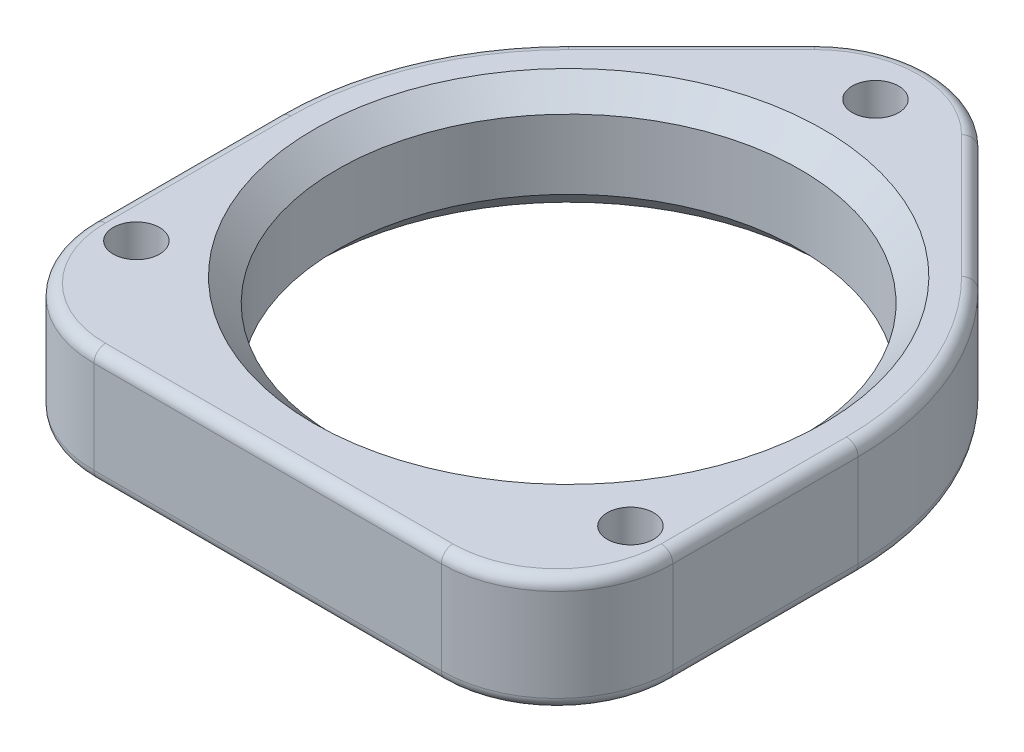
ISO-10303-21;
HEADER;
FILE_DESCRIPTION(('STEP AP214'),'2;1');
FILE_NAME('part.step','',(''),(''),'','','');
FILE_SCHEMA(('AUTOMOTIVE_DESIGN { 1 0 10303 214 1 1 1 1 }'));
ENDSEC;
DATA;
#1=APPLICATION_CONTEXT('core data for automotive mechanical design processes');
#2=APPLICATION_PROTOCOL_DEFINITION('international standard','automotive_design',2000,#1);
#3=PRODUCT_CONTEXT('',#1,'mechanical');
#4=PRODUCT('Part','Part','',(#3));
#5=PRODUCT_RELATED_PRODUCT_CATEGORY('part','',(#4));
#6=PRODUCT_DEFINITION_FORMATION('','',#4);
#7=PRODUCT_DEFINITION_CONTEXT('part definition',#1,'design');
#8=PRODUCT_DEFINITION('design','',#6,#7);
#9=PRODUCT_DEFINITION_SHAPE('','',#8);
#10=(LENGTH_UNIT() NAMED_UNIT(*) SI_UNIT(.MILLI.,.METRE.));
#11=(NAMED_UNIT(*) PLANE_ANGLE_UNIT() SI_UNIT($,.RADIAN.));
#12=(NAMED_UNIT(*) SI_UNIT($,.STERADIAN.) SOLID_ANGLE_UNIT());
#13=UNCERTAINTY_MEASURE_WITH_UNIT(LENGTH_MEASURE(1.E-05),#10,'distance_accuracy_value','');
#14=(GEOMETRIC_REPRESENTATION_CONTEXT(3) GLOBAL_UNCERTAINTY_ASSIGNED_CONTEXT((#13)) GLOBAL_UNIT_ASSIGNED_CONTEXT((#10,
#11,#12)) REPRESENTATION_CONTEXT('',''));
#15=CARTESIAN_POINT('',(0.,0.,0.));
#16=DIRECTION('',(0.,0.,1.));
#17=DIRECTION('',(1.,0.,0.));
#18=AXIS2_PLACEMENT_3D('',#15,#16,#17);
#19=CARTESIAN_POINT('',(0.,10.,0.));
#20=DIRECTION('',(0.,-1.,0.));
#21=DIRECTION('',(0.,0.,-1.));
#22=AXIS2_PLACEMENT_3D('',#19,#20,#21);
#23=CYLINDRICAL_SURFACE('',#22,25.);
#24=DIRECTION('',(0.,1.,0.));
#25=VECTOR('',#24,1.);
#26=CARTESIAN_POINT('',(25.,0.,0.));
#27=LINE('',#26,#25);
#28=CARTESIAN_POINT('',(25.,1.,0.));
#29=VERTEX_POINT('',#28);
#30=CARTESIAN_POINT('',(25.,9.,0.));
#31=VERTEX_POINT('',#30);
#32=EDGE_CURVE('E352',#29,#31,#27,.T.);
#33=ORIENTED_EDGE('',*,*,#32,.F.);
#34=CARTESIAN_POINT('',(0.,0.999999999999999,0.));
#35=DIRECTION('',(0.,1.,0.));
#36=DIRECTION('',(0.,0.,1.));
#37=AXIS2_PLACEMENT_3D('',#34,#35,#36);
#38=CIRCLE('',#37,25.);
#39=CARTESIAN_POINT('',(17.6776695296638,0.999999999999999,-17.6776695296636));
#40=VERTEX_POINT('',#39);
#41=EDGE_CURVE('E257',#29,#40,#38,.T.);
#42=ORIENTED_EDGE('',*,*,#41,.T.);
#43=DIRECTION('',(0.,1.,0.));
#44=VECTOR('',#43,1.);
#45=CARTESIAN_POINT('',(17.6776695296638,0.,-17.6776695296636));
#46=LINE('',#45,#44);
#47=CARTESIAN_POINT('',(17.6776695296638,9.,-17.6776695296636));
#48=VERTEX_POINT('',#47);
#49=EDGE_CURVE('E845',#40,#48,#46,.T.);
#50=ORIENTED_EDGE('',*,*,#49,.T.);
#51=CARTESIAN_POINT('',(0.,9.,0.));
#52=DIRECTION('',(0.,1.,0.));
#53=DIRECTION('',(0.,0.,1.));
#54=AXIS2_PLACEMENT_3D('',#51,#52,#53);
#55=CIRCLE('',#54,25.);
#56=EDGE_CURVE('E255',#48,#31,#55,.F.);
#57=ORIENTED_EDGE('',*,*,#56,.T.);
#58=EDGE_LOOP('',(#33,#42,#50,#57));
#59=FACE_BOUND('',#58,.T.);
#60=ADVANCED_FACE('F41',(#59),#23,.T.);
#61=DIRECTION('',(0.,1.,0.));
#62=VECTOR('',#61,1.);
#63=CARTESIAN_POINT('',(-17.6776695296638,0.,-17.6776695296636));
#64=LINE('',#63,#62);
#65=CARTESIAN_POINT('',(-17.6776695296638,1.,-17.6776695296636));
#66=VERTEX_POINT('',#65);
#67=CARTESIAN_POINT('',(-17.6776695296638,9.,-17.6776695296636));
#68=VERTEX_POINT('',#67);
#69=EDGE_CURVE('E848',#66,#68,#64,.T.);
#70=ORIENTED_EDGE('',*,*,#69,.F.);
#71=CARTESIAN_POINT('',(0.,0.999999999999999,0.));
#72=DIRECTION('',(0.,1.,0.));
#73=DIRECTION('',(0.,0.,1.));
#74=AXIS2_PLACEMENT_3D('',#71,#72,#73);
#75=CIRCLE('',#74,25.);
#76=CARTESIAN_POINT('',(-25.,0.999999999999999,0.));
#77=VERTEX_POINT('',#76);
#78=EDGE_CURVE('E241',#66,#77,#75,.T.);
#79=ORIENTED_EDGE('',*,*,#78,.T.);
#80=DIRECTION('',(0.,1.,0.));
#81=VECTOR('',#80,1.);
#82=CARTESIAN_POINT('',(-25.,0.,0.));
#83=LINE('',#82,#81);
#84=CARTESIAN_POINT('',(-25.,9.,0.));
#85=VERTEX_POINT('',#84);
#86=EDGE_CURVE('E852',#77,#85,#83,.T.);
#87=ORIENTED_EDGE('',*,*,#86,.T.);
#88=CARTESIAN_POINT('',(0.,9.,0.));
#89=DIRECTION('',(0.,1.,0.));
#90=DIRECTION('',(0.,0.,1.));
#91=AXIS2_PLACEMENT_3D('',#88,#89,#90);
#92=CIRCLE('',#91,25.);
#93=EDGE_CURVE('E238',#85,#68,#92,.F.);
#94=ORIENTED_EDGE('',*,*,#93,.T.);
#95=EDGE_LOOP('',(#70,#79,#87,#94));
#96=FACE_BOUND('',#95,.T.);
#97=ADVANCED_FACE('F390',(#96),#23,.T.);
#98=CARTESIAN_POINT('',(0.,10.,0.));
#99=DIRECTION('',(0.,1.,0.));
#100=DIRECTION('',(0.,0.,1.));
#101=AXIS2_PLACEMENT_3D('',#98,#99,#100);
#102=PLANE('',#101);
#103=DIRECTION('',(0.707106781186544,0.,-0.707106781186551));
#104=VECTOR('',#103,1.);
#105=CARTESIAN_POINT('',(-16.9705627484772,10.,-16.970562748477));
#106=LINE('',#105,#104);
#107=CARTESIAN_POINT('',(-6.36396103067896,10.,-27.5771644662754));
#108=VERTEX_POINT('',#107);
#109=CARTESIAN_POINT('',(-16.9705627484772,10.,-16.970562748477));
#110=VERTEX_POINT('',#109);
#111=EDGE_CURVE('E266',#108,#110,#106,.F.);
#112=ORIENTED_EDGE('',*,*,#111,.T.);
#113=CARTESIAN_POINT('',(0.,10.,0.));
#114=DIRECTION('',(0.,1.,0.));
#115=DIRECTION('',(0.,0.,1.));
#116=AXIS2_PLACEMENT_3D('',#113,#114,#115);
#117=CIRCLE('',#116,24.);
#118=CARTESIAN_POINT('',(-24.,10.,0.));
#119=VERTEX_POINT('',#118);
#120=EDGE_CURVE('E283',#110,#119,#117,.T.);
#121=ORIENTED_EDGE('',*,*,#120,.T.);
#122=DIRECTION('',(0.,0.,1.));
#123=VECTOR('',#122,1.);
#124=CARTESIAN_POINT('',(-24.,10.,0.));
#125=LINE('',#124,#123);
#126=CARTESIAN_POINT('',(-24.,10.,16.));
#127=VERTEX_POINT('',#126);
#128=EDGE_CURVE('E65',#119,#127,#125,.T.);
#129=ORIENTED_EDGE('',*,*,#128,.T.);
#130=CARTESIAN_POINT('',(-15.,10.,16.));
#131=DIRECTION('',(0.,1.,0.));
#132=DIRECTION('',(0.,0.,1.));
#133=AXIS2_PLACEMENT_3D('',#130,#131,#132);
#134=CIRCLE('',#133,9.);
#135=CARTESIAN_POINT('',(-15.,10.,25.));
#136=VERTEX_POINT('',#135);
#137=EDGE_CURVE('E280',#127,#136,#134,.T.);
#138=ORIENTED_EDGE('',*,*,#137,.T.);
#139=DIRECTION('',(1.,0.,0.));
#140=VECTOR('',#139,1.);
#141=CARTESIAN_POINT('',(0.,10.,25.));
#142=LINE('',#141,#140);
#143=CARTESIAN_POINT('',(15.,10.,25.));
#144=VERTEX_POINT('',#143);
#145=EDGE_CURVE('E278',#136,#144,#142,.T.);
#146=ORIENTED_EDGE('',*,*,#145,.T.);
#147=CARTESIAN_POINT('',(15.,10.,16.));
#148=DIRECTION('',(0.,1.,0.));
#149=DIRECTION('',(0.,0.,1.));
#150=AXIS2_PLACEMENT_3D('',#147,#148,#149);
#151=CIRCLE('',#150,9.);
#152=CARTESIAN_POINT('',(24.,10.,16.));
#153=VERTEX_POINT('',#152);
#154=EDGE_CURVE('E276',#144,#153,#151,.T.);
#155=ORIENTED_EDGE('',*,*,#154,.T.);
#156=DIRECTION('',(0.,0.,-1.));
#157=VECTOR('',#156,1.);
#158=CARTESIAN_POINT('',(24.,10.,0.));
#159=LINE('',#158,#157);
#160=CARTESIAN_POINT('',(24.,10.,0.));
#161=VERTEX_POINT('',#160);
#162=EDGE_CURVE('E274',#153,#161,#159,.T.);
#163=ORIENTED_EDGE('',*,*,#162,.T.);
#164=CARTESIAN_POINT('',(0.,10.,0.));
#165=DIRECTION('',(0.,1.,0.));
#166=DIRECTION('',(0.,0.,1.));
#167=AXIS2_PLACEMENT_3D('',#164,#165,#166);
#168=CIRCLE('',#167,24.);
#169=CARTESIAN_POINT('',(16.9705627484772,10.,-16.9705627484771));
#170=VERTEX_POINT('',#169);
#171=EDGE_CURVE('E272',#161,#170,#168,.T.);
#172=ORIENTED_EDGE('',*,*,#171,.T.);
#173=DIRECTION('',(0.707106781186544,0.,0.707106781186551));
#174=VECTOR('',#173,1.);
#175=CARTESIAN_POINT('',(6.36396103067895,10.,-27.5771644662754));
#176=LINE('',#175,#174);
#177=CARTESIAN_POINT('',(6.36396103067896,10.,-27.5771644662754));
#178=VERTEX_POINT('',#177);
#179=EDGE_CURVE('E270',#170,#178,#176,.F.);
#180=ORIENTED_EDGE('',*,*,#179,.T.);
#181=CARTESIAN_POINT('',(0.,10.,-21.2132034355965));
#182=DIRECTION('',(0.,1.,0.));
#183=DIRECTION('',(0.,0.,1.));
#184=AXIS2_PLACEMENT_3D('',#181,#182,#183);
#185=CIRCLE('',#184,9.);
#186=EDGE_CURVE('E268',#178,#108,#185,.T.);
#187=ORIENTED_EDGE('',*,*,#186,.T.);
#188=EDGE_LOOP('',(#112,#121,#129,#138,#146,#155,#163,#172,#180,#187));
#189=FACE_BOUND('',#188,.T.);
#190=CARTESIAN_POINT('',(0.,10.,0.));
#191=DIRECTION('',(0.,1.,0.));
#192=DIRECTION('',(0.,0.,1.));
#193=AXIS2_PLACEMENT_3D('',#190,#191,#192);
#194=CIRCLE('',#193,22.);
#195=CARTESIAN_POINT('',(0.,10.,22.));
#196=VERTEX_POINT('',#195);
#197=EDGE_CURVE('E207',#196,#196,#194,.F.);
#198=ORIENTED_EDGE('',*,*,#197,.T.);
#199=EDGE_LOOP('',(#198));
#200=FACE_BOUND('',#199,.T.);
#201=CARTESIAN_POINT('',(-21.335,10.,16.));
#202=DIRECTION('',(0.,1.,0.));
#203=DIRECTION('',(0.,0.,1.));
#204=AXIS2_PLACEMENT_3D('',#201,#202,#203);
#205=CIRCLE('',#204,2.);
#206=CARTESIAN_POINT('',(-21.335,10.,18.));
#207=VERTEX_POINT('',#206);
#208=EDGE_CURVE('E828',#207,#207,#205,.T.);
#209=ORIENTED_EDGE('',*,*,#208,.F.);
#210=EDGE_LOOP('',(#209));
#211=FACE_BOUND('',#210,.T.);
#212=CARTESIAN_POINT('',(0.,10.,-26.5));
#213=DIRECTION('',(0.,1.,0.));
#214=DIRECTION('',(0.,0.,1.));
#215=AXIS2_PLACEMENT_3D('',#212,#213,#214);
#216=CIRCLE('',#215,2.);
#217=CARTESIAN_POINT('',(0.,10.,-24.5));
#218=VERTEX_POINT('',#217);
#219=EDGE_CURVE('E832',#218,#218,#216,.T.);
#220=ORIENTED_EDGE('',*,*,#219,.F.);
#221=EDGE_LOOP('',(#220));
#222=FACE_BOUND('',#221,.T.);
#223=CARTESIAN_POINT('',(21.335,10.,16.));
#224=DIRECTION('',(0.,1.,0.));
#225=DIRECTION('',(0.,0.,1.));
#226=AXIS2_PLACEMENT_3D('',#223,#224,#225);
#227=CIRCLE('',#226,2.);
#228=CARTESIAN_POINT('',(21.335,10.,18.));
#229=VERTEX_POINT('',#228);
#230=EDGE_CURVE('E835',#229,#229,#227,.T.);
#231=ORIENTED_EDGE('',*,*,#230,.F.);
#232=EDGE_LOOP('',(#231));
#233=FACE_BOUND('',#232,.T.);
#234=ADVANCED_FACE('F396',(#189,#200,#211,#222,#233),#102,.T.);
#235=CARTESIAN_POINT('',(0.,0.,0.));
#236=DIRECTION('',(0.,1.,0.));
#237=DIRECTION('',(0.,0.,1.));
#238=AXIS2_PLACEMENT_3D('',#235,#236,#237);
#239=PLANE('',#238);
#240=DIRECTION('',(1.,0.,0.));
#241=VECTOR('',#240,1.);
#242=CARTESIAN_POINT('',(-15.,0.,25.));
#243=LINE('',#242,#241);
#244=CARTESIAN_POINT('',(15.,0.,25.));
#245=VERTEX_POINT('',#244);
#246=CARTESIAN_POINT('',(-15.,0.,25.));
#247=VERTEX_POINT('',#246);
#248=EDGE_CURVE('E186',#245,#247,#243,.F.);
#249=ORIENTED_EDGE('',*,*,#248,.T.);
#250=CARTESIAN_POINT('',(-15.,0.,16.));
#251=DIRECTION('',(0.,1.,0.));
#252=DIRECTION('',(0.,0.,1.));
#253=AXIS2_PLACEMENT_3D('',#250,#251,#252);
#254=CIRCLE('',#253,9.);
#255=CARTESIAN_POINT('',(-24.,0.,16.));
#256=VERTEX_POINT('',#255);
#257=EDGE_CURVE('E227',#247,#256,#254,.F.);
#258=ORIENTED_EDGE('',*,*,#257,.T.);
#259=DIRECTION('',(0.,0.,1.));
#260=VECTOR('',#259,1.);
#261=CARTESIAN_POINT('',(-24.,0.,0.));
#262=LINE('',#261,#260);
#263=CARTESIAN_POINT('',(-24.,0.,0.));
#264=VERTEX_POINT('',#263);
#265=EDGE_CURVE('E225',#256,#264,#262,.F.);
#266=ORIENTED_EDGE('',*,*,#265,.T.);
#267=CARTESIAN_POINT('',(0.,0.,0.));
#268=DIRECTION('',(0.,1.,0.));
#269=DIRECTION('',(0.,0.,1.));
#270=AXIS2_PLACEMENT_3D('',#267,#268,#269);
#271=CIRCLE('',#270,24.);
#272=CARTESIAN_POINT('',(-16.9705627484772,0.,-16.970562748477));
#273=VERTEX_POINT('',#272);
#274=EDGE_CURVE('E223',#264,#273,#271,.F.);
#275=ORIENTED_EDGE('',*,*,#274,.T.);
#276=DIRECTION('',(0.707106781186544,0.,-0.707106781186551));
#277=VECTOR('',#276,1.);
#278=CARTESIAN_POINT('',(-16.9705627484772,0.,-16.970562748477));
#279=LINE('',#278,#277);
#280=CARTESIAN_POINT('',(-6.36396103067896,0.,-27.5771644662754));
#281=VERTEX_POINT('',#280);
#282=EDGE_CURVE('E221',#273,#281,#279,.T.);
#283=ORIENTED_EDGE('',*,*,#282,.T.);
#284=CARTESIAN_POINT('',(0.,0.,-21.2132034355965));
#285=DIRECTION('',(0.,1.,0.));
#286=DIRECTION('',(0.,0.,1.));
#287=AXIS2_PLACEMENT_3D('',#284,#285,#286);
#288=CIRCLE('',#287,9.);
#289=CARTESIAN_POINT('',(6.36396103067896,0.,-27.5771644662754));
#290=VERTEX_POINT('',#289);
#291=EDGE_CURVE('E219',#281,#290,#288,.F.);
#292=ORIENTED_EDGE('',*,*,#291,.T.);
#293=DIRECTION('',(0.707106781186544,0.,0.707106781186551));
#294=VECTOR('',#293,1.);
#295=CARTESIAN_POINT('',(16.9705627484772,0.,-16.9705627484771));
#296=LINE('',#295,#294);
#297=CARTESIAN_POINT('',(16.9705627484772,0.,-16.9705627484771));
#298=VERTEX_POINT('',#297);
#299=EDGE_CURVE('E217',#290,#298,#296,.T.);
#300=ORIENTED_EDGE('',*,*,#299,.T.);
#301=CARTESIAN_POINT('',(0.,0.,0.));
#302=DIRECTION('',(0.,1.,0.));
#303=DIRECTION('',(0.,0.,1.));
#304=AXIS2_PLACEMENT_3D('',#301,#302,#303);
#305=CIRCLE('',#304,24.);
#306=CARTESIAN_POINT('',(24.,0.,0.));
#307=VERTEX_POINT('',#306);
#308=EDGE_CURVE('E215',#298,#307,#305,.F.);
#309=ORIENTED_EDGE('',*,*,#308,.T.);
#310=DIRECTION('',(0.,0.,-1.));
#311=VECTOR('',#310,1.);
#312=CARTESIAN_POINT('',(24.,0.,16.));
#313=LINE('',#312,#311);
#314=CARTESIAN_POINT('',(24.,0.,16.));
#315=VERTEX_POINT('',#314);
#316=EDGE_CURVE('E189',#307,#315,#313,.F.);
#317=ORIENTED_EDGE('',*,*,#316,.T.);
#318=CARTESIAN_POINT('',(15.,0.,16.));
#319=DIRECTION('',(0.,1.,0.));
#320=DIRECTION('',(0.,0.,1.));
#321=AXIS2_PLACEMENT_3D('',#318,#319,#320);
#322=CIRCLE('',#321,9.);
#323=EDGE_CURVE('E180',#315,#245,#322,.F.);
#324=ORIENTED_EDGE('',*,*,#323,.T.);
#325=EDGE_LOOP('',(#249,#258,#266,#275,#283,#292,#300,#309,#317,#324));
#326=FACE_BOUND('',#325,.T.);
#327=CARTESIAN_POINT('',(0.,0.,0.));
#328=DIRECTION('',(0.,1.,0.));
#329=DIRECTION('',(0.,0.,1.));
#330=AXIS2_PLACEMENT_3D('',#327,#328,#329);
#331=CIRCLE('',#330,22.);
#332=CARTESIAN_POINT('',(0.,0.,22.));
#333=VERTEX_POINT('',#332);
#334=EDGE_CURVE('E862',#333,#333,#331,.T.);
#335=ORIENTED_EDGE('',*,*,#334,.T.);
#336=EDGE_LOOP('',(#335));
#337=FACE_BOUND('',#336,.T.);
#338=CARTESIAN_POINT('',(-21.335,0.,16.));
#339=DIRECTION('',(0.,1.,0.));
#340=DIRECTION('',(0.,0.,1.));
#341=AXIS2_PLACEMENT_3D('',#338,#339,#340);
#342=CIRCLE('',#341,2.);
#343=CARTESIAN_POINT('',(-21.335,0.,18.));
#344=VERTEX_POINT('',#343);
#345=EDGE_CURVE('E851',#344,#344,#342,.T.);
#346=ORIENTED_EDGE('',*,*,#345,.T.);
#347=EDGE_LOOP('',(#346));
#348=FACE_BOUND('',#347,.T.);
#349=CARTESIAN_POINT('',(0.,0.,-26.5));
#350=DIRECTION('',(0.,1.,0.));
#351=DIRECTION('',(0.,0.,1.));
#352=AXIS2_PLACEMENT_3D('',#349,#350,#351);
#353=CIRCLE('',#352,2.);
#354=CARTESIAN_POINT('',(0.,0.,-24.5));
#355=VERTEX_POINT('',#354);
#356=EDGE_CURVE('E837',#355,#355,#353,.T.);
#357=ORIENTED_EDGE('',*,*,#356,.T.);
#358=EDGE_LOOP('',(#357));
#359=FACE_BOUND('',#358,.T.);
#360=CARTESIAN_POINT('',(21.335,0.,16.));
#361=DIRECTION('',(0.,1.,0.));
#362=DIRECTION('',(0.,0.,1.));
#363=AXIS2_PLACEMENT_3D('',#360,#361,#362);
#364=CIRCLE('',#363,2.);
#365=CARTESIAN_POINT('',(21.335,0.,18.));
#366=VERTEX_POINT('',#365);
#367=EDGE_CURVE('E307',#366,#366,#364,.T.);
#368=ORIENTED_EDGE('',*,*,#367,.T.);
#369=EDGE_LOOP('',(#368));
#370=FACE_BOUND('',#369,.T.);
#371=ADVANCED_FACE('F182',(#326,#337,#348,#359,#370),#239,.F.);
#372=CARTESIAN_POINT('',(0.,10.,0.));
#373=DIRECTION('',(0.,-1.,0.));
#374=DIRECTION('',(0.,0.,-1.));
#375=AXIS2_PLACEMENT_3D('',#372,#373,#374);
#376=CYLINDRICAL_SURFACE('',#375,20.);
#377=CARTESIAN_POINT('',(0.,7.99999999999999,0.));
#378=DIRECTION('',(0.,1.,0.));
#379=DIRECTION('',(0.,0.,1.));
#380=AXIS2_PLACEMENT_3D('',#377,#378,#379);
#381=CIRCLE('',#380,20.);
#382=CARTESIAN_POINT('',(0.,7.99999999999999,20.));
#383=VERTEX_POINT('',#382);
#384=EDGE_CURVE('E210',#383,#383,#381,.T.);
#385=ORIENTED_EDGE('',*,*,#384,.T.);
#386=EDGE_LOOP('',(#385));
#387=FACE_BOUND('',#386,.T.);
#388=CARTESIAN_POINT('',(0.,2.00000000000001,0.));
#389=DIRECTION('',(0.,1.,0.));
#390=DIRECTION('',(0.,0.,1.));
#391=AXIS2_PLACEMENT_3D('',#388,#389,#390);
#392=CIRCLE('',#391,20.);
#393=CARTESIAN_POINT('',(0.,2.00000000000001,20.));
#394=VERTEX_POINT('',#393);
#395=EDGE_CURVE('E865',#394,#394,#392,.F.);
#396=ORIENTED_EDGE('',*,*,#395,.T.);
#397=EDGE_LOOP('',(#396));
#398=FACE_BOUND('',#397,.T.);
#399=ADVANCED_FACE('F368',(#387,#398),#376,.F.);
#400=CARTESIAN_POINT('',(-25.,0.,0.));
#401=DIRECTION('',(-1.,0.,0.));
#402=DIRECTION('',(0.,0.,1.));
#403=AXIS2_PLACEMENT_3D('',#400,#401,#402);
#404=PLANE('',#403);
#405=ORIENTED_EDGE('',*,*,#86,.F.);
#406=DIRECTION('',(0.,0.,1.));
#407=VECTOR('',#406,1.);
#408=CARTESIAN_POINT('',(-25.,1.,16.));
#409=LINE('',#408,#407);
#410=CARTESIAN_POINT('',(-25.,1.,16.));
#411=VERTEX_POINT('',#410);
#412=EDGE_CURVE('E236',#77,#411,#409,.T.);
#413=ORIENTED_EDGE('',*,*,#412,.T.);
#414=DIRECTION('',(0.,1.,0.));
#415=VECTOR('',#414,1.);
#416=CARTESIAN_POINT('',(-25.,0.,16.));
#417=LINE('',#416,#415);
#418=CARTESIAN_POINT('',(-25.,9.,16.));
#419=VERTEX_POINT('',#418);
#420=EDGE_CURVE('E357',#411,#419,#417,.T.);
#421=ORIENTED_EDGE('',*,*,#420,.T.);
#422=DIRECTION('',(0.,0.,1.));
#423=VECTOR('',#422,1.);
#424=CARTESIAN_POINT('',(-25.,9.,0.));
#425=LINE('',#424,#423);
#426=EDGE_CURVE('E234',#419,#85,#425,.F.);
#427=ORIENTED_EDGE('',*,*,#426,.T.);
#428=EDGE_LOOP('',(#405,#413,#421,#427));
#429=FACE_BOUND('',#428,.T.);
#430=ADVANCED_FACE('F743',(#429),#404,.T.);
#431=CARTESIAN_POINT('',(25.,0.,0.));
#432=DIRECTION('',(1.,0.,0.));
#433=DIRECTION('',(0.,0.,-1.));
#434=AXIS2_PLACEMENT_3D('',#431,#432,#433);
#435=PLANE('',#434);
#436=DIRECTION('',(0.,1.,0.));
#437=VECTOR('',#436,1.);
#438=CARTESIAN_POINT('',(25.,0.,16.));
#439=LINE('',#438,#437);
#440=CARTESIAN_POINT('',(25.,9.,16.));
#441=VERTEX_POINT('',#440);
#442=CARTESIAN_POINT('',(25.,1.,16.));
#443=VERTEX_POINT('',#442);
#444=EDGE_CURVE('E349',#441,#443,#439,.F.);
#445=ORIENTED_EDGE('',*,*,#444,.T.);
#446=DIRECTION('',(0.,0.,-1.));
#447=VECTOR('',#446,1.);
#448=CARTESIAN_POINT('',(25.,1.,0.));
#449=LINE('',#448,#447);
#450=EDGE_CURVE('E261',#443,#29,#449,.T.);
#451=ORIENTED_EDGE('',*,*,#450,.T.);
#452=ORIENTED_EDGE('',*,*,#32,.T.);
#453=DIRECTION('',(0.,0.,-1.));
#454=VECTOR('',#453,1.);
#455=CARTESIAN_POINT('',(25.,9.,0.));
#456=LINE('',#455,#454);
#457=EDGE_CURVE('E259',#31,#441,#456,.F.);
#458=ORIENTED_EDGE('',*,*,#457,.T.);
#459=EDGE_LOOP('',(#445,#451,#452,#458));
#460=FACE_BOUND('',#459,.T.);
#461=ADVANCED_FACE('F348',(#460),#435,.T.);
#462=CARTESIAN_POINT('',(-25.,0.,26.));
#463=DIRECTION('',(0.,0.,1.));
#464=DIRECTION('',(1.,0.,0.));
#465=AXIS2_PLACEMENT_3D('',#462,#463,#464);
#466=PLANE('',#465);
#467=DIRECTION('',(0.,1.,0.));
#468=VECTOR('',#467,1.);
#469=CARTESIAN_POINT('',(15.,0.,26.));
#470=LINE('',#469,#468);
#471=CARTESIAN_POINT('',(15.,1.,26.));
#472=VERTEX_POINT('',#471);
#473=CARTESIAN_POINT('',(15.,9.,26.));
#474=VERTEX_POINT('',#473);
#475=EDGE_CURVE('E358',#472,#474,#470,.T.);
#476=ORIENTED_EDGE('',*,*,#475,.T.);
#477=DIRECTION('',(1.,0.,0.));
#478=VECTOR('',#477,1.);
#479=CARTESIAN_POINT('',(-25.,9.,26.));
#480=LINE('',#479,#478);
#481=CARTESIAN_POINT('',(-15.,9.,26.));
#482=VERTEX_POINT('',#481);
#483=EDGE_CURVE('E11',#474,#482,#480,.F.);
#484=ORIENTED_EDGE('',*,*,#483,.T.);
#485=DIRECTION('',(0.,1.,0.));
#486=VECTOR('',#485,1.);
#487=CARTESIAN_POINT('',(-15.,0.,26.));
#488=LINE('',#487,#486);
#489=CARTESIAN_POINT('',(-15.,1.,26.));
#490=VERTEX_POINT('',#489);
#491=EDGE_CURVE('E362',#482,#490,#488,.F.);
#492=ORIENTED_EDGE('',*,*,#491,.T.);
#493=DIRECTION('',(1.,0.,0.));
#494=VECTOR('',#493,1.);
#495=CARTESIAN_POINT('',(15.,1.,26.));
#496=LINE('',#495,#494);
#497=EDGE_CURVE('E50',#490,#472,#496,.T.);
#498=ORIENTED_EDGE('',*,*,#497,.T.);
#499=EDGE_LOOP('',(#476,#484,#492,#498));
#500=FACE_BOUND('',#499,.T.);
#501=ADVANCED_FACE('F715',(#500),#466,.T.);
#502=CARTESIAN_POINT('',(17.6776695296638,0.,-17.6776695296636));
#503=DIRECTION('',(-0.707106781186551,0.,0.707106781186544));
#504=DIRECTION('',(0.707106781186544,0.,0.707106781186551));
#505=AXIS2_PLACEMENT_3D('',#502,#503,#504);
#506=PLANE('',#505);
#507=ORIENTED_EDGE('',*,*,#49,.F.);
#508=DIRECTION('',(0.707106781186544,0.,0.707106781186551));
#509=VECTOR('',#508,1.);
#510=CARTESIAN_POINT('',(17.6776695296638,1.,-17.6776695296636));
#511=LINE('',#510,#509);
#512=CARTESIAN_POINT('',(7.07106781186551,1.,-28.284271247462));
#513=VERTEX_POINT('',#512);
#514=EDGE_CURVE('E253',#40,#513,#511,.F.);
#515=ORIENTED_EDGE('',*,*,#514,.T.);
#516=DIRECTION('',(0.,1.,0.));
#517=VECTOR('',#516,1.);
#518=CARTESIAN_POINT('',(7.07106781186551,0.,-28.284271247462));
#519=LINE('',#518,#517);
#520=CARTESIAN_POINT('',(7.07106781186551,9.,-28.284271247462));
#521=VERTEX_POINT('',#520);
#522=EDGE_CURVE('E855',#513,#521,#519,.T.);
#523=ORIENTED_EDGE('',*,*,#522,.T.);
#524=DIRECTION('',(0.707106781186544,0.,0.707106781186551));
#525=VECTOR('',#524,1.);
#526=CARTESIAN_POINT('',(17.6776695296638,9.,-17.6776695296636));
#527=LINE('',#526,#525);
#528=EDGE_CURVE('E251',#521,#48,#527,.T.);
#529=ORIENTED_EDGE('',*,*,#528,.T.);
#530=EDGE_LOOP('',(#507,#515,#523,#529));
#531=FACE_BOUND('',#530,.T.);
#532=ADVANCED_FACE('F705',(#531),#506,.F.);
#533=CARTESIAN_POINT('',(-17.6776695296638,0.,-17.6776695296636));
#534=DIRECTION('',(0.707106781186551,0.,0.707106781186544));
#535=DIRECTION('',(0.707106781186544,0.,-0.707106781186551));
#536=AXIS2_PLACEMENT_3D('',#533,#534,#535);
#537=PLANE('',#536);
#538=DIRECTION('',(0.,1.,0.));
#539=VECTOR('',#538,1.);
#540=CARTESIAN_POINT('',(-7.07106781186551,0.,-28.284271247462));
#541=LINE('',#540,#539);
#542=CARTESIAN_POINT('',(-7.07106781186551,9.,-28.284271247462));
#543=VERTEX_POINT('',#542);
#544=CARTESIAN_POINT('',(-7.07106781186551,1.,-28.284271247462));
#545=VERTEX_POINT('',#544);
#546=EDGE_CURVE('E859',#543,#545,#541,.F.);
#547=ORIENTED_EDGE('',*,*,#546,.T.);
#548=DIRECTION('',(0.707106781186544,0.,-0.707106781186551));
#549=VECTOR('',#548,1.);
#550=CARTESIAN_POINT('',(-17.6776695296638,1.,-17.6776695296636));
#551=LINE('',#550,#549);
#552=EDGE_CURVE('E245',#545,#66,#551,.F.);
#553=ORIENTED_EDGE('',*,*,#552,.T.);
#554=ORIENTED_EDGE('',*,*,#69,.T.);
#555=DIRECTION('',(0.707106781186544,0.,-0.707106781186551));
#556=VECTOR('',#555,1.);
#557=CARTESIAN_POINT('',(-7.07106781186551,9.,-28.284271247462));
#558=LINE('',#557,#556);
#559=EDGE_CURVE('E243',#68,#543,#558,.T.);
#560=ORIENTED_EDGE('',*,*,#559,.T.);
#561=EDGE_LOOP('',(#547,#553,#554,#560));
#562=FACE_BOUND('',#561,.T.);
#563=ADVANCED_FACE('F405',(#562),#537,.F.);
#564=CARTESIAN_POINT('',(0.,0.,-21.2132034355965));
#565=DIRECTION('',(0.,1.,0.));
#566=DIRECTION('',(0.,0.,1.));
#567=AXIS2_PLACEMENT_3D('',#564,#565,#566);
#568=CYLINDRICAL_SURFACE('',#567,10.);
#569=ORIENTED_EDGE('',*,*,#522,.F.);
#570=CARTESIAN_POINT('',(0.,1.,-21.2132034355965));
#571=DIRECTION('',(0.,1.,0.));
#572=DIRECTION('',(0.,0.,1.));
#573=AXIS2_PLACEMENT_3D('',#570,#571,#572);
#574=CIRCLE('',#573,10.);
#575=EDGE_CURVE('E249',#513,#545,#574,.T.);
#576=ORIENTED_EDGE('',*,*,#575,.T.);
#577=ORIENTED_EDGE('',*,*,#546,.F.);
#578=CARTESIAN_POINT('',(0.,9.,-21.2132034355965));
#579=DIRECTION('',(0.,1.,0.));
#580=DIRECTION('',(0.,0.,1.));
#581=AXIS2_PLACEMENT_3D('',#578,#579,#580);
#582=CIRCLE('',#581,10.);
#583=EDGE_CURVE('E247',#543,#521,#582,.F.);
#584=ORIENTED_EDGE('',*,*,#583,.T.);
#585=EDGE_LOOP('',(#569,#576,#577,#584));
#586=FACE_BOUND('',#585,.T.);
#587=ADVANCED_FACE('F401',(#586),#568,.T.);
#588=CARTESIAN_POINT('',(21.335,0.,16.));
#589=DIRECTION('',(0.,1.,0.));
#590=DIRECTION('',(0.,0.,1.));
#591=AXIS2_PLACEMENT_3D('',#588,#589,#590);
#592=CYLINDRICAL_SURFACE('',#591,2.);
#593=ORIENTED_EDGE('',*,*,#367,.F.);
#594=EDGE_LOOP('',(#593));
#595=FACE_BOUND('',#594,.T.);
#596=ORIENTED_EDGE('',*,*,#230,.T.);
#597=EDGE_LOOP('',(#596));
#598=FACE_BOUND('',#597,.T.);
#599=ADVANCED_FACE('F404',(#595,#598),#592,.F.);
#600=CARTESIAN_POINT('',(0.,0.,-26.5));
#601=DIRECTION('',(0.,1.,0.));
#602=DIRECTION('',(0.,0.,1.));
#603=AXIS2_PLACEMENT_3D('',#600,#601,#602);
#604=CYLINDRICAL_SURFACE('',#603,2.);
#605=ORIENTED_EDGE('',*,*,#356,.F.);
#606=EDGE_LOOP('',(#605));
#607=FACE_BOUND('',#606,.T.);
#608=ORIENTED_EDGE('',*,*,#219,.T.);
#609=EDGE_LOOP('',(#608));
#610=FACE_BOUND('',#609,.T.);
#611=ADVANCED_FACE('F672',(#607,#610),#604,.F.);
#612=CARTESIAN_POINT('',(-21.335,0.,16.));
#613=DIRECTION('',(0.,1.,0.));
#614=DIRECTION('',(0.,0.,1.));
#615=AXIS2_PLACEMENT_3D('',#612,#613,#614);
#616=CYLINDRICAL_SURFACE('',#615,2.);
#617=ORIENTED_EDGE('',*,*,#345,.F.);
#618=EDGE_LOOP('',(#617));
#619=FACE_BOUND('',#618,.T.);
#620=ORIENTED_EDGE('',*,*,#208,.T.);
#621=EDGE_LOOP('',(#620));
#622=FACE_BOUND('',#621,.T.);
#623=ADVANCED_FACE('F413',(#619,#622),#616,.F.);
#624=CARTESIAN_POINT('',(0.,0.,0.));
#625=DIRECTION('',(0.,-1.,0.));
#626=DIRECTION('',(0.,0.,-1.));
#627=AXIS2_PLACEMENT_3D('',#624,#625,#626);
#628=CONICAL_SURFACE('',#627,22.,0.785398163397447);
#629=ORIENTED_EDGE('',*,*,#395,.F.);
#630=EDGE_LOOP('',(#629));
#631=FACE_BOUND('',#630,.T.);
#632=ORIENTED_EDGE('',*,*,#334,.F.);
#633=EDGE_LOOP('',(#632));
#634=FACE_BOUND('',#633,.T.);
#635=ADVANCED_FACE('F408',(#631,#634),#628,.F.);
#636=CARTESIAN_POINT('',(15.,0.,16.));
#637=DIRECTION('',(0.,1.,0.));
#638=DIRECTION('',(0.,0.,1.));
#639=AXIS2_PLACEMENT_3D('',#636,#637,#638);
#640=CYLINDRICAL_SURFACE('',#639,10.);
#641=ORIENTED_EDGE('',*,*,#475,.F.);
#642=CARTESIAN_POINT('',(15.,1.,16.));
#643=DIRECTION('',(0.,1.,0.));
#644=DIRECTION('',(0.,0.,1.));
#645=AXIS2_PLACEMENT_3D('',#642,#643,#644);
#646=CIRCLE('',#645,10.);
#647=EDGE_CURVE('E198',#472,#443,#646,.T.);
#648=ORIENTED_EDGE('',*,*,#647,.T.);
#649=ORIENTED_EDGE('',*,*,#444,.F.);
#650=CARTESIAN_POINT('',(15.,9.,16.));
#651=DIRECTION('',(0.,1.,0.));
#652=DIRECTION('',(0.,0.,1.));
#653=AXIS2_PLACEMENT_3D('',#650,#651,#652);
#654=CIRCLE('',#653,10.);
#655=EDGE_CURVE('E263',#441,#474,#654,.F.);
#656=ORIENTED_EDGE('',*,*,#655,.T.);
#657=EDGE_LOOP('',(#641,#648,#649,#656));
#658=FACE_BOUND('',#657,.T.);
#659=ADVANCED_FACE('F355',(#658),#640,.T.);
#660=CARTESIAN_POINT('',(-15.,0.,16.));
#661=DIRECTION('',(0.,1.,0.));
#662=DIRECTION('',(0.,0.,1.));
#663=AXIS2_PLACEMENT_3D('',#660,#661,#662);
#664=CYLINDRICAL_SURFACE('',#663,10.);
#665=ORIENTED_EDGE('',*,*,#420,.F.);
#666=CARTESIAN_POINT('',(-15.,1.,16.));
#667=DIRECTION('',(0.,1.,0.));
#668=DIRECTION('',(0.,0.,1.));
#669=AXIS2_PLACEMENT_3D('',#666,#667,#668);
#670=CIRCLE('',#669,10.);
#671=EDGE_CURVE('E231',#411,#490,#670,.T.);
#672=ORIENTED_EDGE('',*,*,#671,.T.);
#673=ORIENTED_EDGE('',*,*,#491,.F.);
#674=CARTESIAN_POINT('',(-15.,9.,16.));
#675=DIRECTION('',(0.,1.,0.));
#676=DIRECTION('',(0.,0.,1.));
#677=AXIS2_PLACEMENT_3D('',#674,#675,#676);
#678=CIRCLE('',#677,10.);
#679=EDGE_CURVE('E229',#482,#419,#678,.F.);
#680=ORIENTED_EDGE('',*,*,#679,.T.);
#681=EDGE_LOOP('',(#665,#672,#673,#680));
#682=FACE_BOUND('',#681,.T.);
#683=ADVANCED_FACE('F374',(#682),#664,.T.);
#684=CARTESIAN_POINT('',(0.,7.99999999999999,0.));
#685=DIRECTION('',(0.,1.,0.));
#686=DIRECTION('',(0.,0.,1.));
#687=AXIS2_PLACEMENT_3D('',#684,#685,#686);
#688=CONICAL_SURFACE('',#687,20.,0.78539816339745);
#689=ORIENTED_EDGE('',*,*,#197,.F.);
#690=EDGE_LOOP('',(#689));
#691=FACE_BOUND('',#690,.T.);
#692=ORIENTED_EDGE('',*,*,#384,.F.);
#693=EDGE_LOOP('',(#692));
#694=FACE_BOUND('',#693,.T.);
#695=ADVANCED_FACE('F371',(#691,#694),#688,.F.);
#696=CARTESIAN_POINT('',(16.9705627484772,1.,-16.9705627484771));
#697=DIRECTION('',(0.707106781186544,0.,0.707106781186551));
#698=DIRECTION('',(0.707106781186551,0.,-0.707106781186544));
#699=AXIS2_PLACEMENT_3D('',#696,#697,#698);
#700=CYLINDRICAL_SURFACE('',#699,1.);
#701=CARTESIAN_POINT('',(6.36396103067896,1.,-27.5771644662754));
#702=DIRECTION('',(-0.707106781186544,0.,-0.70710678118655));
#703=DIRECTION('',(-0.707106781186551,0.,0.707106781186545));
#704=AXIS2_PLACEMENT_3D('',#701,#702,#703);
#705=CIRCLE('',#704,1.);
#706=EDGE_CURVE('E301',#513,#290,#705,.T.);
#707=ORIENTED_EDGE('',*,*,#706,.F.);
#708=ORIENTED_EDGE('',*,*,#514,.F.);
#709=CARTESIAN_POINT('',(16.9705627484772,1.,-16.9705627484771));
#710=DIRECTION('',(0.707106781186542,0.,0.707106781186553));
#711=DIRECTION('',(0.707106781186553,0.,-0.707106781186542));
#712=AXIS2_PLACEMENT_3D('',#709,#710,#711);
#713=CIRCLE('',#712,1.);
#714=EDGE_CURVE('E304',#298,#40,#713,.T.);
#715=ORIENTED_EDGE('',*,*,#714,.F.);
#716=ORIENTED_EDGE('',*,*,#299,.F.);
#717=EDGE_LOOP('',(#707,#708,#715,#716));
#718=FACE_BOUND('',#717,.T.);
#719=ADVANCED_FACE('F373',(#718),#700,.T.);
#720=CARTESIAN_POINT('',(0.,0.999999999999999,0.));
#721=DIRECTION('',(0.,1.,0.));
#722=DIRECTION('',(0.,0.,1.));
#723=AXIS2_PLACEMENT_3D('',#720,#721,#722);
#724=TOROIDAL_SURFACE('',#723,24.,1.);
#725=ORIENTED_EDGE('',*,*,#714,.T.);
#726=ORIENTED_EDGE('',*,*,#41,.F.);
#727=CARTESIAN_POINT('',(24.,1.,0.));
#728=DIRECTION('',(0.,0.,1.));
#729=DIRECTION('',(1.,0.,0.));
#730=AXIS2_PLACEMENT_3D('',#727,#728,#729);
#731=CIRCLE('',#730,1.);
#732=EDGE_CURVE('E298',#307,#29,#731,.T.);
#733=ORIENTED_EDGE('',*,*,#732,.F.);
#734=ORIENTED_EDGE('',*,*,#308,.F.);
#735=EDGE_LOOP('',(#725,#726,#733,#734));
#736=FACE_BOUND('',#735,.T.);
#737=ADVANCED_FACE('F381',(#736),#724,.T.);
#738=CARTESIAN_POINT('',(0.,1.,-21.2132034355965));
#739=DIRECTION('',(0.,1.,0.));
#740=DIRECTION('',(0.,0.,1.));
#741=AXIS2_PLACEMENT_3D('',#738,#739,#740);
#742=TOROIDAL_SURFACE('',#741,9.,1.);
#743=ORIENTED_EDGE('',*,*,#706,.T.);
#744=ORIENTED_EDGE('',*,*,#291,.F.);
#745=CARTESIAN_POINT('',(-6.36396103067896,1.,-27.5771644662754));
#746=DIRECTION('',(-0.707106781186544,0.,0.70710678118655));
#747=DIRECTION('',(0.707106781186551,0.,0.707106781186545));
#748=AXIS2_PLACEMENT_3D('',#745,#746,#747);
#749=CIRCLE('',#748,1.);
#750=EDGE_CURVE('E295',#545,#281,#749,.T.);
#751=ORIENTED_EDGE('',*,*,#750,.F.);
#752=ORIENTED_EDGE('',*,*,#575,.F.);
#753=EDGE_LOOP('',(#743,#744,#751,#752));
#754=FACE_BOUND('',#753,.T.);
#755=ADVANCED_FACE('F444',(#754),#742,.T.);
#756=CARTESIAN_POINT('',(24.,1.,0.));
#757=DIRECTION('',(0.,0.,1.));
#758=DIRECTION('',(1.,0.,0.));
#759=AXIS2_PLACEMENT_3D('',#756,#757,#758);
#760=CYLINDRICAL_SURFACE('',#759,1.);
#761=ORIENTED_EDGE('',*,*,#732,.T.);
#762=ORIENTED_EDGE('',*,*,#450,.F.);
#763=CARTESIAN_POINT('',(24.,1.,16.));
#764=DIRECTION('',(0.,0.,1.));
#765=DIRECTION('',(1.,0.,0.));
#766=AXIS2_PLACEMENT_3D('',#763,#764,#765);
#767=CIRCLE('',#766,1.);
#768=EDGE_CURVE('E293',#315,#443,#767,.T.);
#769=ORIENTED_EDGE('',*,*,#768,.F.);
#770=ORIENTED_EDGE('',*,*,#316,.F.);
#771=EDGE_LOOP('',(#761,#762,#769,#770));
#772=FACE_BOUND('',#771,.T.);
#773=ADVANCED_FACE('F455',(#772),#760,.T.);
#774=CARTESIAN_POINT('',(-16.9705627484772,1.,-16.970562748477));
#775=DIRECTION('',(0.707106781186544,0.,-0.707106781186551));
#776=DIRECTION('',(-0.707106781186551,0.,-0.707106781186544));
#777=AXIS2_PLACEMENT_3D('',#774,#775,#776);
#778=CYLINDRICAL_SURFACE('',#777,1.);
#779=ORIENTED_EDGE('',*,*,#750,.T.);
#780=ORIENTED_EDGE('',*,*,#282,.F.);
#781=CARTESIAN_POINT('',(-16.9705627484772,1.,-16.970562748477));
#782=DIRECTION('',(-0.707106781186544,0.,0.707106781186551));
#783=DIRECTION('',(0.707106781186551,0.,0.707106781186544));
#784=AXIS2_PLACEMENT_3D('',#781,#782,#783);
#785=CIRCLE('',#784,1.);
#786=EDGE_CURVE('E201',#66,#273,#785,.T.);
#787=ORIENTED_EDGE('',*,*,#786,.F.);
#788=ORIENTED_EDGE('',*,*,#552,.F.);
#789=EDGE_LOOP('',(#779,#780,#787,#788));
#790=FACE_BOUND('',#789,.T.);
#791=ADVANCED_FACE('F466',(#790),#778,.T.);
#792=CARTESIAN_POINT('',(15.,1.,16.));
#793=DIRECTION('',(0.,1.,0.));
#794=DIRECTION('',(0.,0.,1.));
#795=AXIS2_PLACEMENT_3D('',#792,#793,#794);
#796=TOROIDAL_SURFACE('',#795,9.,1.);
#797=ORIENTED_EDGE('',*,*,#768,.T.);
#798=ORIENTED_EDGE('',*,*,#647,.F.);
#799=CARTESIAN_POINT('',(15.,1.,25.));
#800=DIRECTION('',(-1.,0.,0.));
#801=DIRECTION('',(0.,0.,1.));
#802=AXIS2_PLACEMENT_3D('',#799,#800,#801);
#803=CIRCLE('',#802,1.);
#804=EDGE_CURVE('E196',#245,#472,#803,.T.);
#805=ORIENTED_EDGE('',*,*,#804,.F.);
#806=ORIENTED_EDGE('',*,*,#323,.F.);
#807=EDGE_LOOP('',(#797,#798,#805,#806));
#808=FACE_BOUND('',#807,.T.);
#809=ADVANCED_FACE('F197',(#808),#796,.T.);
#810=CARTESIAN_POINT('',(0.,0.999999999999999,0.));
#811=DIRECTION('',(0.,1.,0.));
#812=DIRECTION('',(0.,0.,1.));
#813=AXIS2_PLACEMENT_3D('',#810,#811,#812);
#814=TOROIDAL_SURFACE('',#813,24.,1.);
#815=ORIENTED_EDGE('',*,*,#786,.T.);
#816=ORIENTED_EDGE('',*,*,#274,.F.);
#817=CARTESIAN_POINT('',(-24.,0.999999999999999,0.));
#818=DIRECTION('',(0.,0.,1.));
#819=DIRECTION('',(0.,-1.,0.));
#820=AXIS2_PLACEMENT_3D('',#817,#818,#819);
#821=CIRCLE('',#820,1.);
#822=EDGE_CURVE('E202',#77,#264,#821,.T.);
#823=ORIENTED_EDGE('',*,*,#822,.F.);
#824=ORIENTED_EDGE('',*,*,#78,.F.);
#825=EDGE_LOOP('',(#815,#816,#823,#824));
#826=FACE_BOUND('',#825,.T.);
#827=ADVANCED_FACE('F487',(#826),#814,.T.);
#828=CARTESIAN_POINT('',(-25.,1.,25.));
#829=DIRECTION('',(-1.,0.,0.));
#830=DIRECTION('',(0.,0.,1.));
#831=AXIS2_PLACEMENT_3D('',#828,#829,#830);
#832=CYLINDRICAL_SURFACE('',#831,1.);
#833=ORIENTED_EDGE('',*,*,#804,.T.);
#834=ORIENTED_EDGE('',*,*,#497,.F.);
#835=CARTESIAN_POINT('',(-15.,1.,25.));
#836=DIRECTION('',(-1.,0.,0.));
#837=DIRECTION('',(0.,0.,1.));
#838=AXIS2_PLACEMENT_3D('',#835,#836,#837);
#839=CIRCLE('',#838,1.);
#840=EDGE_CURVE('E205',#247,#490,#839,.T.);
#841=ORIENTED_EDGE('',*,*,#840,.F.);
#842=ORIENTED_EDGE('',*,*,#248,.F.);
#843=EDGE_LOOP('',(#833,#834,#841,#842));
#844=FACE_BOUND('',#843,.T.);
#845=ADVANCED_FACE('F204',(#844),#832,.T.);
#846=CARTESIAN_POINT('',(-24.,1.,0.));
#847=DIRECTION('',(0.,0.,-1.));
#848=DIRECTION('',(-1.,0.,0.));
#849=AXIS2_PLACEMENT_3D('',#846,#847,#848);
#850=CYLINDRICAL_SURFACE('',#849,1.);
#851=ORIENTED_EDGE('',*,*,#822,.T.);
#852=ORIENTED_EDGE('',*,*,#265,.F.);
#853=CARTESIAN_POINT('',(-24.,1.,16.));
#854=DIRECTION('',(0.,0.,1.));
#855=DIRECTION('',(1.,0.,0.));
#856=AXIS2_PLACEMENT_3D('',#853,#854,#855);
#857=CIRCLE('',#856,1.);
#858=EDGE_CURVE('E286',#411,#256,#857,.T.);
#859=ORIENTED_EDGE('',*,*,#858,.F.);
#860=ORIENTED_EDGE('',*,*,#412,.F.);
#861=EDGE_LOOP('',(#851,#852,#859,#860));
#862=FACE_BOUND('',#861,.T.);
#863=ADVANCED_FACE('F507',(#862),#850,.T.);
#864=CARTESIAN_POINT('',(-15.,1.,16.));
#865=DIRECTION('',(0.,1.,0.));
#866=DIRECTION('',(0.,0.,1.));
#867=AXIS2_PLACEMENT_3D('',#864,#865,#866);
#868=TOROIDAL_SURFACE('',#867,9.,1.);
#869=ORIENTED_EDGE('',*,*,#840,.T.);
#870=ORIENTED_EDGE('',*,*,#671,.F.);
#871=ORIENTED_EDGE('',*,*,#858,.T.);
#872=ORIENTED_EDGE('',*,*,#257,.F.);
#873=EDGE_LOOP('',(#869,#870,#871,#872));
#874=FACE_BOUND('',#873,.T.);
#875=ADVANCED_FACE('F517',(#874),#868,.T.);
#876=CARTESIAN_POINT('',(24.,9.,0.));
#877=DIRECTION('',(0.,0.,-1.));
#878=DIRECTION('',(-1.,0.,0.));
#879=AXIS2_PLACEMENT_3D('',#876,#877,#878);
#880=CYLINDRICAL_SURFACE('',#879,1.);
#881=CARTESIAN_POINT('',(24.,9.,16.));
#882=DIRECTION('',(0.,0.,1.));
#883=DIRECTION('',(1.,0.,0.));
#884=AXIS2_PLACEMENT_3D('',#881,#882,#883);
#885=CIRCLE('',#884,1.);
#886=EDGE_CURVE('E328',#441,#153,#885,.T.);
#887=ORIENTED_EDGE('',*,*,#886,.F.);
#888=ORIENTED_EDGE('',*,*,#457,.F.);
#889=CARTESIAN_POINT('',(24.,9.,0.));
#890=DIRECTION('',(0.,0.,-1.));
#891=DIRECTION('',(-1.,0.,0.));
#892=AXIS2_PLACEMENT_3D('',#889,#890,#891);
#893=CIRCLE('',#892,1.);
#894=EDGE_CURVE('E45',#161,#31,#893,.T.);
#895=ORIENTED_EDGE('',*,*,#894,.F.);
#896=ORIENTED_EDGE('',*,*,#162,.F.);
#897=EDGE_LOOP('',(#887,#888,#895,#896));
#898=FACE_BOUND('',#897,.T.);
#899=ADVANCED_FACE('F43',(#898),#880,.T.);
#900=CARTESIAN_POINT('',(0.,9.,0.));
#901=DIRECTION('',(0.,1.,0.));
#902=DIRECTION('',(0.,0.,1.));
#903=AXIS2_PLACEMENT_3D('',#900,#901,#902);
#904=TOROIDAL_SURFACE('',#903,24.,1.);
#905=ORIENTED_EDGE('',*,*,#894,.T.);
#906=ORIENTED_EDGE('',*,*,#56,.F.);
#907=CARTESIAN_POINT('',(16.9705627484772,9.,-16.9705627484771));
#908=DIRECTION('',(-0.707106781186544,0.,-0.707106781186551));
#909=DIRECTION('',(-0.707106781186551,0.,0.707106781186544));
#910=AXIS2_PLACEMENT_3D('',#907,#908,#909);
#911=CIRCLE('',#910,1.);
#912=EDGE_CURVE('E326',#170,#48,#911,.T.);
#913=ORIENTED_EDGE('',*,*,#912,.F.);
#914=ORIENTED_EDGE('',*,*,#171,.F.);
#915=EDGE_LOOP('',(#905,#906,#913,#914));
#916=FACE_BOUND('',#915,.T.);
#917=ADVANCED_FACE('F339',(#916),#904,.T.);
#918=CARTESIAN_POINT('',(15.,9.,16.));
#919=DIRECTION('',(0.,1.,0.));
#920=DIRECTION('',(0.,0.,1.));
#921=AXIS2_PLACEMENT_3D('',#918,#919,#920);
#922=TOROIDAL_SURFACE('',#921,9.,1.);
#923=ORIENTED_EDGE('',*,*,#886,.T.);
#924=ORIENTED_EDGE('',*,*,#154,.F.);
#925=CARTESIAN_POINT('',(15.,9.,25.));
#926=DIRECTION('',(-1.,0.,0.));
#927=DIRECTION('',(0.,0.,1.));
#928=AXIS2_PLACEMENT_3D('',#925,#926,#927);
#929=CIRCLE('',#928,1.);
#930=EDGE_CURVE('E323',#474,#144,#929,.T.);
#931=ORIENTED_EDGE('',*,*,#930,.F.);
#932=ORIENTED_EDGE('',*,*,#655,.F.);
#933=EDGE_LOOP('',(#923,#924,#931,#932));
#934=FACE_BOUND('',#933,.T.);
#935=ADVANCED_FACE('F545',(#934),#922,.T.);
#936=CARTESIAN_POINT('',(16.9705627484772,9.,-16.9705627484771));
#937=DIRECTION('',(-0.707106781186544,0.,-0.707106781186551));
#938=DIRECTION('',(-0.707106781186551,0.,0.707106781186544));
#939=AXIS2_PLACEMENT_3D('',#936,#937,#938);
#940=CYLINDRICAL_SURFACE('',#939,1.);
#941=ORIENTED_EDGE('',*,*,#912,.T.);
#942=ORIENTED_EDGE('',*,*,#528,.F.);
#943=CARTESIAN_POINT('',(6.36396103067896,9.,-27.5771644662754));
#944=DIRECTION('',(-0.707106781186544,0.,-0.707106781186551));
#945=DIRECTION('',(-0.707106781186551,0.,0.707106781186544));
#946=AXIS2_PLACEMENT_3D('',#943,#944,#945);
#947=CIRCLE('',#946,1.);
#948=EDGE_CURVE('E320',#178,#521,#947,.T.);
#949=ORIENTED_EDGE('',*,*,#948,.F.);
#950=ORIENTED_EDGE('',*,*,#179,.F.);
#951=EDGE_LOOP('',(#941,#942,#949,#950));
#952=FACE_BOUND('',#951,.T.);
#953=ADVANCED_FACE('F554',(#952),#940,.T.);
#954=CARTESIAN_POINT('',(0.,9.,25.));
#955=DIRECTION('',(1.,0.,0.));
#956=DIRECTION('',(0.,0.,-1.));
#957=AXIS2_PLACEMENT_3D('',#954,#955,#956);
#958=CYLINDRICAL_SURFACE('',#957,1.);
#959=ORIENTED_EDGE('',*,*,#930,.T.);
#960=ORIENTED_EDGE('',*,*,#145,.F.);
#961=CARTESIAN_POINT('',(-15.,9.,25.));
#962=DIRECTION('',(-1.,0.,0.));
#963=DIRECTION('',(0.,0.,1.));
#964=AXIS2_PLACEMENT_3D('',#961,#962,#963);
#965=CIRCLE('',#964,1.);
#966=EDGE_CURVE('E317',#482,#136,#965,.T.);
#967=ORIENTED_EDGE('',*,*,#966,.F.);
#968=ORIENTED_EDGE('',*,*,#483,.F.);
#969=EDGE_LOOP('',(#959,#960,#967,#968));
#970=FACE_BOUND('',#969,.T.);
#971=ADVANCED_FACE('F564',(#970),#958,.T.);
#972=CARTESIAN_POINT('',(0.,9.,-21.2132034355965));
#973=DIRECTION('',(0.,1.,0.));
#974=DIRECTION('',(0.,0.,1.));
#975=AXIS2_PLACEMENT_3D('',#972,#973,#974);
#976=TOROIDAL_SURFACE('',#975,9.,1.);
#977=ORIENTED_EDGE('',*,*,#948,.T.);
#978=ORIENTED_EDGE('',*,*,#583,.F.);
#979=CARTESIAN_POINT('',(-6.36396103067897,9.,-27.5771644662754));
#980=DIRECTION('',(-0.707106781186544,0.,0.707106781186551));
#981=DIRECTION('',(0.707106781186551,0.,0.707106781186544));
#982=AXIS2_PLACEMENT_3D('',#979,#980,#981);
#983=CIRCLE('',#982,1.);
#984=EDGE_CURVE('E314',#108,#543,#983,.T.);
#985=ORIENTED_EDGE('',*,*,#984,.F.);
#986=ORIENTED_EDGE('',*,*,#186,.F.);
#987=EDGE_LOOP('',(#977,#978,#985,#986));
#988=FACE_BOUND('',#987,.T.);
#989=ADVANCED_FACE('F575',(#988),#976,.T.);
#990=CARTESIAN_POINT('',(-15.,9.,16.));
#991=DIRECTION('',(0.,1.,0.));
#992=DIRECTION('',(0.,0.,1.));
#993=AXIS2_PLACEMENT_3D('',#990,#991,#992);
#994=TOROIDAL_SURFACE('',#993,9.,1.);
#995=ORIENTED_EDGE('',*,*,#966,.T.);
#996=ORIENTED_EDGE('',*,*,#137,.F.);
#997=CARTESIAN_POINT('',(-24.,9.,16.));
#998=DIRECTION('',(0.,0.,-1.));
#999=DIRECTION('',(-1.,0.,0.));
#1000=AXIS2_PLACEMENT_3D('',#997,#998,#999);
#1001=CIRCLE('',#1000,1.);
#1002=EDGE_CURVE('E311',#419,#127,#1001,.T.);
#1003=ORIENTED_EDGE('',*,*,#1002,.F.);
#1004=ORIENTED_EDGE('',*,*,#679,.F.);
#1005=EDGE_LOOP('',(#995,#996,#1003,#1004));
#1006=FACE_BOUND('',#1005,.T.);
#1007=ADVANCED_FACE('F586',(#1006),#994,.T.);
#1008=CARTESIAN_POINT('',(-16.9705627484772,9.,-16.970562748477));
#1009=DIRECTION('',(-0.707106781186544,0.,0.707106781186551));
#1010=DIRECTION('',(0.707106781186551,0.,0.707106781186544));
#1011=AXIS2_PLACEMENT_3D('',#1008,#1009,#1010);
#1012=CYLINDRICAL_SURFACE('',#1011,1.);
#1013=ORIENTED_EDGE('',*,*,#984,.T.);
#1014=ORIENTED_EDGE('',*,*,#559,.F.);
#1015=CARTESIAN_POINT('',(-16.9705627484772,9.,-16.970562748477));
#1016=DIRECTION('',(-0.707106781186544,0.,0.707106781186551));
#1017=DIRECTION('',(0.707106781186551,0.,0.707106781186544));
#1018=AXIS2_PLACEMENT_3D('',#1015,#1016,#1017);
#1019=CIRCLE('',#1018,1.);
#1020=EDGE_CURVE('E309',#110,#68,#1019,.T.);
#1021=ORIENTED_EDGE('',*,*,#1020,.F.);
#1022=ORIENTED_EDGE('',*,*,#111,.F.);
#1023=EDGE_LOOP('',(#1013,#1014,#1021,#1022));
#1024=FACE_BOUND('',#1023,.T.);
#1025=ADVANCED_FACE('F597',(#1024),#1012,.T.);
#1026=CARTESIAN_POINT('',(-24.,9.,0.));
#1027=DIRECTION('',(0.,0.,1.));
#1028=DIRECTION('',(1.,0.,0.));
#1029=AXIS2_PLACEMENT_3D('',#1026,#1027,#1028);
#1030=CYLINDRICAL_SURFACE('',#1029,1.);
#1031=ORIENTED_EDGE('',*,*,#1002,.T.);
#1032=ORIENTED_EDGE('',*,*,#128,.F.);
#1033=CARTESIAN_POINT('',(-24.,9.,0.));
#1034=DIRECTION('',(0.,0.,-1.));
#1035=DIRECTION('',(0.,1.,0.));
#1036=AXIS2_PLACEMENT_3D('',#1033,#1034,#1035);
#1037=CIRCLE('',#1036,1.);
#1038=EDGE_CURVE('E58',#85,#119,#1037,.T.);
#1039=ORIENTED_EDGE('',*,*,#1038,.F.);
#1040=ORIENTED_EDGE('',*,*,#426,.F.);
#1041=EDGE_LOOP('',(#1031,#1032,#1039,#1040));
#1042=FACE_BOUND('',#1041,.T.);
#1043=ADVANCED_FACE('F608',(#1042),#1030,.T.);
#1044=CARTESIAN_POINT('',(0.,9.,0.));
#1045=DIRECTION('',(0.,1.,0.));
#1046=DIRECTION('',(0.,0.,1.));
#1047=AXIS2_PLACEMENT_3D('',#1044,#1045,#1046);
#1048=TOROIDAL_SURFACE('',#1047,24.,1.);
#1049=ORIENTED_EDGE('',*,*,#1020,.T.);
#1050=ORIENTED_EDGE('',*,*,#93,.F.);
#1051=ORIENTED_EDGE('',*,*,#1038,.T.);
#1052=ORIENTED_EDGE('',*,*,#120,.F.);
#1053=EDGE_LOOP('',(#1049,#1050,#1051,#1052));
#1054=FACE_BOUND('',#1053,.T.);
#1055=ADVANCED_FACE('F619',(#1054),#1048,.T.);
#1056=CLOSED_SHELL('',(#60,#97,#234,#371,#399,#430,#461,#501,#532,#563,#587,#599,#611,#623,#635,
#659,#683,#695,#719,#737,#755,#773,#791,#809,#827,#845,#863,#875,#899,#917,#935,#953,#971,#989,
#1007,#1025,#1043,#1055));
#1057=MANIFOLD_SOLID_BREP('B2',#1056);
#1058=ADVANCED_BREP_SHAPE_REPRESENTATION('',(#18,#1057),#14);
#1059=SHAPE_DEFINITION_REPRESENTATION(#9,#1058);
ENDSEC;
END-ISO-10303-21;
